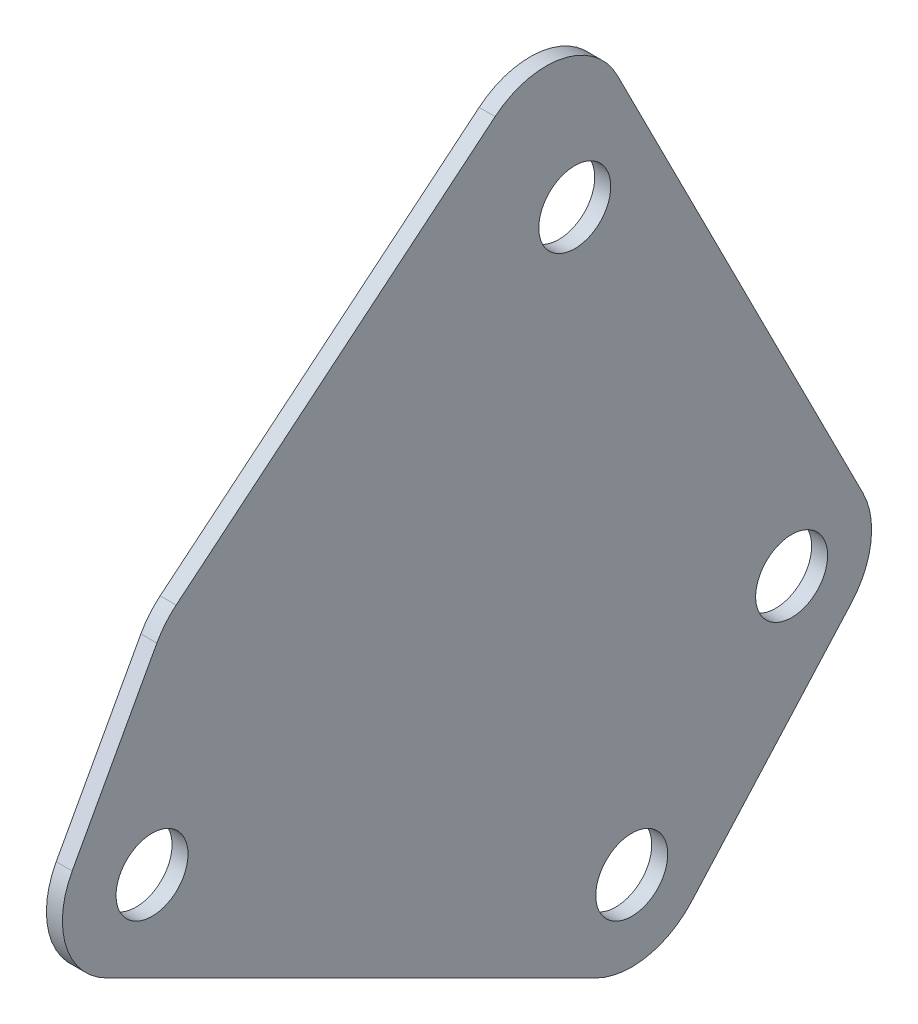
ISO-10303-21;
HEADER;
FILE_DESCRIPTION(('STEP AP214'),'2;1');
FILE_NAME('part.step','',(''),(''),'','','');
FILE_SCHEMA(('AUTOMOTIVE_DESIGN { 1 0 10303 214 1 1 1 1 }'));
ENDSEC;
DATA;
#1=APPLICATION_CONTEXT('core data for automotive mechanical design processes');
#2=APPLICATION_PROTOCOL_DEFINITION('international standard','automotive_design',2000,#1);
#3=PRODUCT_CONTEXT('',#1,'mechanical');
#4=PRODUCT('Part','Part','',(#3));
#5=PRODUCT_RELATED_PRODUCT_CATEGORY('part','',(#4));
#6=PRODUCT_DEFINITION_FORMATION('','',#4);
#7=PRODUCT_DEFINITION_CONTEXT('part definition',#1,'design');
#8=PRODUCT_DEFINITION('design','',#6,#7);
#9=PRODUCT_DEFINITION_SHAPE('','',#8);
#10=(LENGTH_UNIT() NAMED_UNIT(*) SI_UNIT(.MILLI.,.METRE.));
#11=(NAMED_UNIT(*) PLANE_ANGLE_UNIT() SI_UNIT($,.RADIAN.));
#12=(NAMED_UNIT(*) SI_UNIT($,.STERADIAN.) SOLID_ANGLE_UNIT());
#13=UNCERTAINTY_MEASURE_WITH_UNIT(LENGTH_MEASURE(1.E-05),#10,'distance_accuracy_value','');
#14=(GEOMETRIC_REPRESENTATION_CONTEXT(3) GLOBAL_UNCERTAINTY_ASSIGNED_CONTEXT((#13)) GLOBAL_UNIT_ASSIGNED_CONTEXT((#10,
#11,#12)) REPRESENTATION_CONTEXT('',''));
#15=CARTESIAN_POINT('',(0.,0.,0.));
#16=DIRECTION('',(0.,0.,1.));
#17=DIRECTION('',(1.,0.,0.));
#18=AXIS2_PLACEMENT_3D('',#15,#16,#17);
#19=CARTESIAN_POINT('',(0.5,10.,-4.69089770478525));
#20=DIRECTION('',(-1.,0.,0.));
#21=DIRECTION('',(0.,0.,1.));
#22=AXIS2_PLACEMENT_3D('',#19,#20,#21);
#23=PLANE('',#22);
#24=CARTESIAN_POINT('',(0.5,10.,-4.69089770478525));
#25=DIRECTION('',(1.,0.,0.));
#26=DIRECTION('',(0.,0.,1.));
#27=AXIS2_PLACEMENT_3D('',#24,#25,#26);
#28=CIRCLE('',#27,5.);
#29=CARTESIAN_POINT('',(0.5,13.854666903013,-1.50631875823424));
#30=VERTEX_POINT('',#29);
#31=CARTESIAN_POINT('',(0.5,12.397029664678,-0.302931343627311));
#32=VERTEX_POINT('',#31);
#33=EDGE_CURVE('E162',#30,#32,#28,.T.);
#34=ORIENTED_EDGE('',*,*,#33,.T.);
#35=DIRECTION('',(0.,-0.877593272231589,0.479405932935599));
#36=VECTOR('',#35,1.);
#37=CARTESIAN_POINT('',(0.5,2.70015386730591,4.99421476641378));
#38=LINE('',#37,#36);
#39=CARTESIAN_POINT('',(0.5,2.70015386730591,4.99421476641378));
#40=VERTEX_POINT('',#39);
#41=EDGE_CURVE('E100',#32,#40,#38,.T.);
#42=ORIENTED_EDGE('',*,*,#41,.T.);
#43=CARTESIAN_POINT('',(0.5,0.303124202627918,0.606248405255836));
#44=DIRECTION('',(1.,0.,0.));
#45=DIRECTION('',(0.,0.,-1.));
#46=AXIS2_PLACEMENT_3D('',#43,#44,#45);
#47=CIRCLE('',#46,5.);
#48=CARTESIAN_POINT('',(0.5,-4.16901175237166,2.84231638275563));
#49=VERTEX_POINT('',#48);
#50=EDGE_CURVE('E183',#40,#49,#47,.T.);
#51=ORIENTED_EDGE('',*,*,#50,.T.);
#52=DIRECTION('',(0.,-0.447213595499958,-0.894427190999916));
#53=VECTOR('',#52,1.);
#54=CARTESIAN_POINT('',(0.5,-4.16901175237166,2.84231638275562));
#55=LINE('',#54,#53);
#56=CARTESIAN_POINT('',(0.5,-19.4721359549996,-27.7639320225002));
#57=VERTEX_POINT('',#56);
#58=EDGE_CURVE('E202',#49,#57,#55,.T.);
#59=ORIENTED_EDGE('',*,*,#58,.T.);
#60=CARTESIAN_POINT('',(0.5,-15.,-30.));
#61=DIRECTION('',(1.,0.,0.));
#62=DIRECTION('',(0.,0.,1.));
#63=AXIS2_PLACEMENT_3D('',#60,#61,#62);
#64=CIRCLE('',#63,5.);
#65=CARTESIAN_POINT('',(0.5,-18.3333333333333,-33.7267799624997));
#66=VERTEX_POINT('',#65);
#67=EDGE_CURVE('E199',#57,#66,#64,.T.);
#68=ORIENTED_EDGE('',*,*,#67,.T.);
#69=DIRECTION('',(0.,0.74535599249993,-0.666666666666667));
#70=VECTOR('',#69,1.);
#71=CARTESIAN_POINT('',(0.5,-18.3333333333333,-33.7267799624997));
#72=LINE('',#71,#70);
#73=CARTESIAN_POINT('',(0.5,-7.15299344583441,-43.7267799624996));
#74=VERTEX_POINT('',#73);
#75=EDGE_CURVE('E201',#66,#74,#72,.T.);
#76=ORIENTED_EDGE('',*,*,#75,.T.);
#77=CARTESIAN_POINT('',(0.5,-3.81966011250106,-40.));
#78=DIRECTION('',(1.,0.,0.));
#79=DIRECTION('',(0.,0.,-1.));
#80=AXIS2_PLACEMENT_3D('',#77,#78,#79);
#81=CIRCLE('',#80,5.);
#82=CARTESIAN_POINT('',(0.5,-1.55887747786078,-44.4596930251878));
#83=VERTEX_POINT('',#82);
#84=EDGE_CURVE('E125',#74,#83,#81,.T.);
#85=ORIENTED_EDGE('',*,*,#84,.T.);
#86=DIRECTION('',(0.,0.891938605037568,0.452156526928051));
#87=VECTOR('',#86,1.);
#88=CARTESIAN_POINT('',(0.5,-1.55887747786078,-44.4596930251878));
#89=LINE('',#88,#87);
#90=CARTESIAN_POINT('',(0.5,28.741612280431,-29.0992588697998));
#91=VERTEX_POINT('',#90);
#92=EDGE_CURVE('E119',#83,#91,#89,.T.);
#93=ORIENTED_EDGE('',*,*,#92,.T.);
#94=CARTESIAN_POINT('',(0.5,26.4808296457907,-24.639565844612));
#95=DIRECTION('',(1.,0.,0.));
#96=DIRECTION('',(0.,0.,-1.));
#97=AXIS2_PLACEMENT_3D('',#94,#95,#96);
#98=CIRCLE('',#97,5.);
#99=CARTESIAN_POINT('',(0.5,30.3354965488037,-21.454986898061));
#100=VERTEX_POINT('',#99);
#101=EDGE_CURVE('E123',#91,#100,#98,.T.);
#102=ORIENTED_EDGE('',*,*,#101,.T.);
#103=DIRECTION('',(0.,-0.636915789310203,0.770933380602605));
#104=VECTOR('',#103,1.);
#105=CARTESIAN_POINT('',(0.5,13.854666903013,-1.50631875823424));
#106=LINE('',#105,#104);
#107=EDGE_CURVE('E51',#100,#30,#106,.T.);
#108=ORIENTED_EDGE('',*,*,#107,.T.);
#109=EDGE_LOOP('',(#34,#42,#51,#59,#68,#76,#85,#93,#102,#108));
#110=FACE_BOUND('',#109,.T.);
#111=CARTESIAN_POINT('',(0.5,-15.,-30.));
#112=DIRECTION('',(1.,0.,0.));
#113=DIRECTION('',(0.,0.,-1.));
#114=AXIS2_PLACEMENT_3D('',#111,#112,#113);
#115=CIRCLE('',#114,2.25);
#116=CARTESIAN_POINT('',(0.5,-15.,-32.25));
#117=VERTEX_POINT('',#116);
#118=EDGE_CURVE('E147',#117,#117,#115,.T.);
#119=ORIENTED_EDGE('',*,*,#118,.F.);
#120=EDGE_LOOP('',(#119));
#121=FACE_BOUND('',#120,.T.);
#122=CARTESIAN_POINT('',(0.5,-3.81966011250106,-40.));
#123=DIRECTION('',(1.,0.,0.));
#124=DIRECTION('',(0.,0.,-1.));
#125=AXIS2_PLACEMENT_3D('',#122,#123,#124);
#126=CIRCLE('',#125,2.25);
#127=CARTESIAN_POINT('',(0.5,-3.81966011250106,-42.25));
#128=VERTEX_POINT('',#127);
#129=EDGE_CURVE('E213',#128,#128,#126,.T.);
#130=ORIENTED_EDGE('',*,*,#129,.F.);
#131=EDGE_LOOP('',(#130));
#132=FACE_BOUND('',#131,.T.);
#133=CARTESIAN_POINT('',(0.5,0.,0.));
#134=DIRECTION('',(1.,0.,0.));
#135=DIRECTION('',(0.,0.,-1.));
#136=AXIS2_PLACEMENT_3D('',#133,#134,#135);
#137=CIRCLE('',#136,2.25);
#138=CARTESIAN_POINT('',(0.5,0.,-2.25));
#139=VERTEX_POINT('',#138);
#140=EDGE_CURVE('E219',#139,#139,#137,.T.);
#141=ORIENTED_EDGE('',*,*,#140,.F.);
#142=EDGE_LOOP('',(#141));
#143=FACE_BOUND('',#142,.T.);
#144=CARTESIAN_POINT('',(0.5,22.938498038626,-26.4353041921585));
#145=DIRECTION('',(1.,0.,0.));
#146=DIRECTION('',(0.,0.,-1.));
#147=AXIS2_PLACEMENT_3D('',#144,#145,#146);
#148=CIRCLE('',#147,2.25);
#149=CARTESIAN_POINT('',(0.5,22.938498038626,-28.6853041921585));
#150=VERTEX_POINT('',#149);
#151=EDGE_CURVE('E225',#150,#150,#148,.T.);
#152=ORIENTED_EDGE('',*,*,#151,.F.);
#153=EDGE_LOOP('',(#152));
#154=FACE_BOUND('',#153,.T.);
#155=ADVANCED_FACE('F34',(#110,#121,#132,#143,#154),#23,.F.);
#156=CARTESIAN_POINT('',(-0.5,10.,-4.69089770478525));
#157=DIRECTION('',(-1.,0.,0.));
#158=DIRECTION('',(0.,0.,1.));
#159=AXIS2_PLACEMENT_3D('',#156,#157,#158);
#160=PLANE('',#159);
#161=CARTESIAN_POINT('',(-0.5,0.,0.));
#162=DIRECTION('',(1.,0.,0.));
#163=DIRECTION('',(0.,0.,-1.));
#164=AXIS2_PLACEMENT_3D('',#161,#162,#163);
#165=CIRCLE('',#164,2.25);
#166=CARTESIAN_POINT('',(-0.5,0.,-2.25));
#167=VERTEX_POINT('',#166);
#168=EDGE_CURVE('E222',#167,#167,#165,.T.);
#169=ORIENTED_EDGE('',*,*,#168,.T.);
#170=EDGE_LOOP('',(#169));
#171=FACE_BOUND('',#170,.T.);
#172=CARTESIAN_POINT('',(-0.5,-15.,-30.));
#173=DIRECTION('',(1.,0.,0.));
#174=DIRECTION('',(0.,0.,-1.));
#175=AXIS2_PLACEMENT_3D('',#172,#173,#174);
#176=CIRCLE('',#175,2.25);
#177=CARTESIAN_POINT('',(-0.5,-15.,-32.25));
#178=VERTEX_POINT('',#177);
#179=EDGE_CURVE('E210',#178,#178,#176,.T.);
#180=ORIENTED_EDGE('',*,*,#179,.T.);
#181=EDGE_LOOP('',(#180));
#182=FACE_BOUND('',#181,.T.);
#183=CARTESIAN_POINT('',(-0.5,10.,-4.69089770478525));
#184=DIRECTION('',(1.,0.,0.));
#185=DIRECTION('',(0.,0.,1.));
#186=AXIS2_PLACEMENT_3D('',#183,#184,#185);
#187=CIRCLE('',#186,5.);
#188=CARTESIAN_POINT('',(-0.5,13.854666903013,-1.50631875823424));
#189=VERTEX_POINT('',#188);
#190=CARTESIAN_POINT('',(-0.5,12.397029664678,-0.302931343627311));
#191=VERTEX_POINT('',#190);
#192=EDGE_CURVE('E143',#189,#191,#187,.T.);
#193=ORIENTED_EDGE('',*,*,#192,.F.);
#194=DIRECTION('',(0.,-0.636915789310203,0.770933380602605));
#195=VECTOR('',#194,1.);
#196=CARTESIAN_POINT('',(-0.5,13.854666903013,-1.50631875823424));
#197=LINE('',#196,#195);
#198=CARTESIAN_POINT('',(-0.5,30.3354965488037,-21.454986898061));
#199=VERTEX_POINT('',#198);
#200=EDGE_CURVE('E92',#199,#189,#197,.T.);
#201=ORIENTED_EDGE('',*,*,#200,.F.);
#202=CARTESIAN_POINT('',(-0.5,26.4808296457907,-24.639565844612));
#203=DIRECTION('',(1.,0.,0.));
#204=DIRECTION('',(0.,0.,-1.));
#205=AXIS2_PLACEMENT_3D('',#202,#203,#204);
#206=CIRCLE('',#205,5.);
#207=CARTESIAN_POINT('',(-0.5,28.741612280431,-29.0992588697998));
#208=VERTEX_POINT('',#207);
#209=EDGE_CURVE('E86',#208,#199,#206,.T.);
#210=ORIENTED_EDGE('',*,*,#209,.F.);
#211=DIRECTION('',(0.,0.891938605037568,0.452156526928051));
#212=VECTOR('',#211,1.);
#213=CARTESIAN_POINT('',(-0.5,-1.55887747786078,-44.4596930251878));
#214=LINE('',#213,#212);
#215=CARTESIAN_POINT('',(-0.5,-1.55887747786078,-44.4596930251878));
#216=VERTEX_POINT('',#215);
#217=EDGE_CURVE('E133',#216,#208,#214,.T.);
#218=ORIENTED_EDGE('',*,*,#217,.F.);
#219=CARTESIAN_POINT('',(-0.5,-3.81966011250106,-40.));
#220=DIRECTION('',(1.,0.,0.));
#221=DIRECTION('',(0.,0.,-1.));
#222=AXIS2_PLACEMENT_3D('',#219,#220,#221);
#223=CIRCLE('',#222,5.);
#224=CARTESIAN_POINT('',(-0.5,-7.15299344583441,-43.7267799624996));
#225=VERTEX_POINT('',#224);
#226=EDGE_CURVE('E157',#225,#216,#223,.T.);
#227=ORIENTED_EDGE('',*,*,#226,.F.);
#228=DIRECTION('',(0.,0.74535599249993,-0.666666666666667));
#229=VECTOR('',#228,1.);
#230=CARTESIAN_POINT('',(-0.5,-18.3333333333333,-33.7267799624997));
#231=LINE('',#230,#229);
#232=CARTESIAN_POINT('',(-0.5,-18.3333333333333,-33.7267799624997));
#233=VERTEX_POINT('',#232);
#234=EDGE_CURVE('E155',#233,#225,#231,.T.);
#235=ORIENTED_EDGE('',*,*,#234,.F.);
#236=CARTESIAN_POINT('',(-0.5,-15.,-30.));
#237=DIRECTION('',(1.,0.,0.));
#238=DIRECTION('',(0.,0.,1.));
#239=AXIS2_PLACEMENT_3D('',#236,#237,#238);
#240=CIRCLE('',#239,5.);
#241=CARTESIAN_POINT('',(-0.5,-19.4721359549996,-27.7639320225002));
#242=VERTEX_POINT('',#241);
#243=EDGE_CURVE('E153',#242,#233,#240,.T.);
#244=ORIENTED_EDGE('',*,*,#243,.F.);
#245=DIRECTION('',(0.,-0.447213595499958,-0.894427190999916));
#246=VECTOR('',#245,1.);
#247=CARTESIAN_POINT('',(-0.5,-4.16901175237166,2.84231638275562));
#248=LINE('',#247,#246);
#249=CARTESIAN_POINT('',(-0.5,-4.16901175237166,2.84231638275563));
#250=VERTEX_POINT('',#249);
#251=EDGE_CURVE('E151',#250,#242,#248,.T.);
#252=ORIENTED_EDGE('',*,*,#251,.F.);
#253=CARTESIAN_POINT('',(-0.5,0.303124202627918,0.606248405255836));
#254=DIRECTION('',(1.,0.,0.));
#255=DIRECTION('',(0.,0.,-1.));
#256=AXIS2_PLACEMENT_3D('',#253,#254,#255);
#257=CIRCLE('',#256,5.);
#258=CARTESIAN_POINT('',(-0.5,2.70015386730591,4.99421476641378));
#259=VERTEX_POINT('',#258);
#260=EDGE_CURVE('E149',#259,#250,#257,.T.);
#261=ORIENTED_EDGE('',*,*,#260,.F.);
#262=DIRECTION('',(0.,-0.877593272231589,0.479405932935599));
#263=VECTOR('',#262,1.);
#264=CARTESIAN_POINT('',(-0.5,2.70015386730591,4.99421476641378));
#265=LINE('',#264,#263);
#266=EDGE_CURVE('E146',#191,#259,#265,.T.);
#267=ORIENTED_EDGE('',*,*,#266,.F.);
#268=EDGE_LOOP('',(#193,#201,#210,#218,#227,#235,#244,#252,#261,#267));
#269=FACE_BOUND('',#268,.T.);
#270=CARTESIAN_POINT('',(-0.5,-3.81966011250106,-40.));
#271=DIRECTION('',(1.,0.,0.));
#272=DIRECTION('',(0.,0.,-1.));
#273=AXIS2_PLACEMENT_3D('',#270,#271,#272);
#274=CIRCLE('',#273,2.25);
#275=CARTESIAN_POINT('',(-0.5,-3.81966011250106,-42.25));
#276=VERTEX_POINT('',#275);
#277=EDGE_CURVE('E216',#276,#276,#274,.T.);
#278=ORIENTED_EDGE('',*,*,#277,.T.);
#279=EDGE_LOOP('',(#278));
#280=FACE_BOUND('',#279,.T.);
#281=CARTESIAN_POINT('',(-0.5,22.938498038626,-26.4353041921585));
#282=DIRECTION('',(1.,0.,0.));
#283=DIRECTION('',(0.,0.,-1.));
#284=AXIS2_PLACEMENT_3D('',#281,#282,#283);
#285=CIRCLE('',#284,2.25);
#286=CARTESIAN_POINT('',(-0.5,22.938498038626,-28.6853041921585));
#287=VERTEX_POINT('',#286);
#288=EDGE_CURVE('E228',#287,#287,#285,.T.);
#289=ORIENTED_EDGE('',*,*,#288,.T.);
#290=EDGE_LOOP('',(#289));
#291=FACE_BOUND('',#290,.T.);
#292=ADVANCED_FACE('F187',(#171,#182,#269,#280,#291),#160,.T.);
#293=CARTESIAN_POINT('',(0.5,10.,-4.69089770478525));
#294=DIRECTION('',(-1.,0.,0.));
#295=DIRECTION('',(0.,0.,1.));
#296=AXIS2_PLACEMENT_3D('',#293,#294,#295);
#297=CYLINDRICAL_SURFACE('',#296,5.);
#298=ORIENTED_EDGE('',*,*,#192,.T.);
#299=DIRECTION('',(-1.,0.,0.));
#300=VECTOR('',#299,1.);
#301=CARTESIAN_POINT('',(0.5,12.397029664678,-0.302931343627311));
#302=LINE('',#301,#300);
#303=EDGE_CURVE('E11',#32,#191,#302,.T.);
#304=ORIENTED_EDGE('',*,*,#303,.F.);
#305=ORIENTED_EDGE('',*,*,#33,.F.);
#306=DIRECTION('',(-1.,0.,0.));
#307=VECTOR('',#306,1.);
#308=CARTESIAN_POINT('',(0.5,13.854666903013,-1.50631875823424));
#309=LINE('',#308,#307);
#310=EDGE_CURVE('E139',#30,#189,#309,.T.);
#311=ORIENTED_EDGE('',*,*,#310,.T.);
#312=EDGE_LOOP('',(#298,#304,#305,#311));
#313=FACE_BOUND('',#312,.T.);
#314=ADVANCED_FACE('F36',(#313),#297,.T.);
#315=CARTESIAN_POINT('',(0.5,2.70015386730591,4.99421476641378));
#316=DIRECTION('',(0.,-0.479405932935599,-0.877593272231589));
#317=DIRECTION('',(0.,0.877593272231589,-0.479405932935599));
#318=AXIS2_PLACEMENT_3D('',#315,#316,#317);
#319=PLANE('',#318);
#320=ORIENTED_EDGE('',*,*,#266,.T.);
#321=DIRECTION('',(-1.,0.,0.));
#322=VECTOR('',#321,1.);
#323=CARTESIAN_POINT('',(0.5,2.70015386730591,4.99421476641378));
#324=LINE('',#323,#322);
#325=EDGE_CURVE('E43',#40,#259,#324,.T.);
#326=ORIENTED_EDGE('',*,*,#325,.F.);
#327=ORIENTED_EDGE('',*,*,#41,.F.);
#328=ORIENTED_EDGE('',*,*,#303,.T.);
#329=EDGE_LOOP('',(#320,#326,#327,#328));
#330=FACE_BOUND('',#329,.T.);
#331=ADVANCED_FACE('F268',(#330),#319,.F.);
#332=CARTESIAN_POINT('',(0.5,0.303124202627918,0.606248405255836));
#333=DIRECTION('',(-1.,0.,0.));
#334=DIRECTION('',(0.,0.,1.));
#335=AXIS2_PLACEMENT_3D('',#332,#333,#334);
#336=CYLINDRICAL_SURFACE('',#335,5.);
#337=ORIENTED_EDGE('',*,*,#260,.T.);
#338=DIRECTION('',(-1.,0.,0.));
#339=VECTOR('',#338,1.);
#340=CARTESIAN_POINT('',(0.5,-4.16901175237166,2.84231638275563));
#341=LINE('',#340,#339);
#342=EDGE_CURVE('E175',#49,#250,#341,.T.);
#343=ORIENTED_EDGE('',*,*,#342,.F.);
#344=ORIENTED_EDGE('',*,*,#50,.F.);
#345=ORIENTED_EDGE('',*,*,#325,.T.);
#346=EDGE_LOOP('',(#337,#343,#344,#345));
#347=FACE_BOUND('',#346,.T.);
#348=ADVANCED_FACE('F181',(#347),#336,.T.);
#349=CARTESIAN_POINT('',(0.5,-4.16901175237166,2.84231638275562));
#350=DIRECTION('',(0.,0.894427190999916,-0.447213595499958));
#351=DIRECTION('',(0.,0.447213595499958,0.894427190999916));
#352=AXIS2_PLACEMENT_3D('',#349,#350,#351);
#353=PLANE('',#352);
#354=ORIENTED_EDGE('',*,*,#251,.T.);
#355=DIRECTION('',(-1.,0.,0.));
#356=VECTOR('',#355,1.);
#357=CARTESIAN_POINT('',(0.5,-19.4721359549996,-27.7639320225002));
#358=LINE('',#357,#356);
#359=EDGE_CURVE('E172',#57,#242,#358,.T.);
#360=ORIENTED_EDGE('',*,*,#359,.F.);
#361=ORIENTED_EDGE('',*,*,#58,.F.);
#362=ORIENTED_EDGE('',*,*,#342,.T.);
#363=EDGE_LOOP('',(#354,#360,#361,#362));
#364=FACE_BOUND('',#363,.T.);
#365=ADVANCED_FACE('F193',(#364),#353,.F.);
#366=CARTESIAN_POINT('',(0.5,-15.,-30.));
#367=DIRECTION('',(-1.,0.,0.));
#368=DIRECTION('',(0.,0.,1.));
#369=AXIS2_PLACEMENT_3D('',#366,#367,#368);
#370=CYLINDRICAL_SURFACE('',#369,5.);
#371=ORIENTED_EDGE('',*,*,#243,.T.);
#372=DIRECTION('',(-1.,0.,0.));
#373=VECTOR('',#372,1.);
#374=CARTESIAN_POINT('',(0.5,-18.3333333333333,-33.7267799624997));
#375=LINE('',#374,#373);
#376=EDGE_CURVE('E169',#66,#233,#375,.T.);
#377=ORIENTED_EDGE('',*,*,#376,.F.);
#378=ORIENTED_EDGE('',*,*,#67,.F.);
#379=ORIENTED_EDGE('',*,*,#359,.T.);
#380=EDGE_LOOP('',(#371,#377,#378,#379));
#381=FACE_BOUND('',#380,.T.);
#382=ADVANCED_FACE('F197',(#381),#370,.T.);
#383=CARTESIAN_POINT('',(0.5,-18.3333333333333,-33.7267799624997));
#384=DIRECTION('',(0.,0.666666666666667,0.74535599249993));
#385=DIRECTION('',(0.,-0.74535599249993,0.666666666666667));
#386=AXIS2_PLACEMENT_3D('',#383,#384,#385);
#387=PLANE('',#386);
#388=ORIENTED_EDGE('',*,*,#234,.T.);
#389=DIRECTION('',(-1.,0.,0.));
#390=VECTOR('',#389,1.);
#391=CARTESIAN_POINT('',(0.5,-7.15299344583441,-43.7267799624996));
#392=LINE('',#391,#390);
#393=EDGE_CURVE('E166',#74,#225,#392,.T.);
#394=ORIENTED_EDGE('',*,*,#393,.F.);
#395=ORIENTED_EDGE('',*,*,#75,.F.);
#396=ORIENTED_EDGE('',*,*,#376,.T.);
#397=EDGE_LOOP('',(#388,#394,#395,#396));
#398=FACE_BOUND('',#397,.T.);
#399=ADVANCED_FACE('F258',(#398),#387,.F.);
#400=CARTESIAN_POINT('',(0.5,-3.81966011250106,-40.));
#401=DIRECTION('',(-1.,0.,0.));
#402=DIRECTION('',(0.,0.,1.));
#403=AXIS2_PLACEMENT_3D('',#400,#401,#402);
#404=CYLINDRICAL_SURFACE('',#403,5.);
#405=ORIENTED_EDGE('',*,*,#226,.T.);
#406=DIRECTION('',(-1.,0.,0.));
#407=VECTOR('',#406,1.);
#408=CARTESIAN_POINT('',(0.5,-1.55887747786078,-44.4596930251878));
#409=LINE('',#408,#407);
#410=EDGE_CURVE('E134',#83,#216,#409,.T.);
#411=ORIENTED_EDGE('',*,*,#410,.F.);
#412=ORIENTED_EDGE('',*,*,#84,.F.);
#413=ORIENTED_EDGE('',*,*,#393,.T.);
#414=EDGE_LOOP('',(#405,#411,#412,#413));
#415=FACE_BOUND('',#414,.T.);
#416=ADVANCED_FACE('F255',(#415),#404,.T.);
#417=CARTESIAN_POINT('',(0.5,-1.55887747786078,-44.4596930251878));
#418=DIRECTION('',(0.,-0.452156526928051,0.891938605037568));
#419=DIRECTION('',(0.,-0.891938605037568,-0.452156526928051));
#420=AXIS2_PLACEMENT_3D('',#417,#418,#419);
#421=PLANE('',#420);
#422=ORIENTED_EDGE('',*,*,#217,.T.);
#423=DIRECTION('',(-1.,0.,0.));
#424=VECTOR('',#423,1.);
#425=CARTESIAN_POINT('',(0.5,28.741612280431,-29.0992588697998));
#426=LINE('',#425,#424);
#427=EDGE_CURVE('E130',#91,#208,#426,.T.);
#428=ORIENTED_EDGE('',*,*,#427,.F.);
#429=ORIENTED_EDGE('',*,*,#92,.F.);
#430=ORIENTED_EDGE('',*,*,#410,.T.);
#431=EDGE_LOOP('',(#422,#428,#429,#430));
#432=FACE_BOUND('',#431,.T.);
#433=ADVANCED_FACE('F131',(#432),#421,.F.);
#434=CARTESIAN_POINT('',(0.5,26.4808296457907,-24.639565844612));
#435=DIRECTION('',(-1.,0.,0.));
#436=DIRECTION('',(0.,0.,1.));
#437=AXIS2_PLACEMENT_3D('',#434,#435,#436);
#438=CYLINDRICAL_SURFACE('',#437,5.);
#439=ORIENTED_EDGE('',*,*,#209,.T.);
#440=DIRECTION('',(-1.,0.,0.));
#441=VECTOR('',#440,1.);
#442=CARTESIAN_POINT('',(0.5,30.3354965488037,-21.454986898061));
#443=LINE('',#442,#441);
#444=EDGE_CURVE('E135',#100,#199,#443,.T.);
#445=ORIENTED_EDGE('',*,*,#444,.F.);
#446=ORIENTED_EDGE('',*,*,#101,.F.);
#447=ORIENTED_EDGE('',*,*,#427,.T.);
#448=EDGE_LOOP('',(#439,#445,#446,#447));
#449=FACE_BOUND('',#448,.T.);
#450=ADVANCED_FACE('F137',(#449),#438,.T.);
#451=CARTESIAN_POINT('',(0.5,13.854666903013,-1.50631875823424));
#452=DIRECTION('',(0.,-0.770933380602605,-0.636915789310203));
#453=DIRECTION('',(0.,0.636915789310203,-0.770933380602605));
#454=AXIS2_PLACEMENT_3D('',#451,#452,#453);
#455=PLANE('',#454);
#456=ORIENTED_EDGE('',*,*,#200,.T.);
#457=ORIENTED_EDGE('',*,*,#310,.F.);
#458=ORIENTED_EDGE('',*,*,#107,.F.);
#459=ORIENTED_EDGE('',*,*,#444,.T.);
#460=EDGE_LOOP('',(#456,#457,#458,#459));
#461=FACE_BOUND('',#460,.T.);
#462=ADVANCED_FACE('F248',(#461),#455,.F.);
#463=CARTESIAN_POINT('',(0.5,-15.,-30.));
#464=DIRECTION('',(-1.,0.,0.));
#465=DIRECTION('',(0.,0.,1.));
#466=AXIS2_PLACEMENT_3D('',#463,#464,#465);
#467=CYLINDRICAL_SURFACE('',#466,2.25);
#468=ORIENTED_EDGE('',*,*,#118,.T.);
#469=EDGE_LOOP('',(#468));
#470=FACE_BOUND('',#469,.T.);
#471=ORIENTED_EDGE('',*,*,#179,.F.);
#472=EDGE_LOOP('',(#471));
#473=FACE_BOUND('',#472,.T.);
#474=ADVANCED_FACE('F245',(#470,#473),#467,.F.);
#475=CARTESIAN_POINT('',(0.5,-3.81966011250106,-40.));
#476=DIRECTION('',(-1.,0.,0.));
#477=DIRECTION('',(0.,0.,1.));
#478=AXIS2_PLACEMENT_3D('',#475,#476,#477);
#479=CYLINDRICAL_SURFACE('',#478,2.25);
#480=ORIENTED_EDGE('',*,*,#129,.T.);
#481=EDGE_LOOP('',(#480));
#482=FACE_BOUND('',#481,.T.);
#483=ORIENTED_EDGE('',*,*,#277,.F.);
#484=EDGE_LOOP('',(#483));
#485=FACE_BOUND('',#484,.T.);
#486=ADVANCED_FACE('F344',(#482,#485),#479,.F.);
#487=CARTESIAN_POINT('',(0.5,0.,0.));
#488=DIRECTION('',(-1.,0.,0.));
#489=DIRECTION('',(0.,0.,1.));
#490=AXIS2_PLACEMENT_3D('',#487,#488,#489);
#491=CYLINDRICAL_SURFACE('',#490,2.25);
#492=ORIENTED_EDGE('',*,*,#140,.T.);
#493=EDGE_LOOP('',(#492));
#494=FACE_BOUND('',#493,.T.);
#495=ORIENTED_EDGE('',*,*,#168,.F.);
#496=EDGE_LOOP('',(#495));
#497=FACE_BOUND('',#496,.T.);
#498=ADVANCED_FACE('F352',(#494,#497),#491,.F.);
#499=CARTESIAN_POINT('',(0.5,22.938498038626,-26.4353041921585));
#500=DIRECTION('',(-1.,0.,0.));
#501=DIRECTION('',(0.,0.,1.));
#502=AXIS2_PLACEMENT_3D('',#499,#500,#501);
#503=CYLINDRICAL_SURFACE('',#502,2.25);
#504=ORIENTED_EDGE('',*,*,#151,.T.);
#505=EDGE_LOOP('',(#504));
#506=FACE_BOUND('',#505,.T.);
#507=ORIENTED_EDGE('',*,*,#288,.F.);
#508=EDGE_LOOP('',(#507));
#509=FACE_BOUND('',#508,.T.);
#510=ADVANCED_FACE('F234',(#506,#509),#503,.F.);
#511=CLOSED_SHELL('',(#155,#292,#314,#331,#348,#365,#382,#399,#416,#433,#450,#462,#474,#486,
#498,#510));
#512=MANIFOLD_SOLID_BREP('B2',#511);
#513=ADVANCED_BREP_SHAPE_REPRESENTATION('',(#18,#512),#14);
#514=SHAPE_DEFINITION_REPRESENTATION(#9,#513);
ENDSEC;
END-ISO-10303-21;
